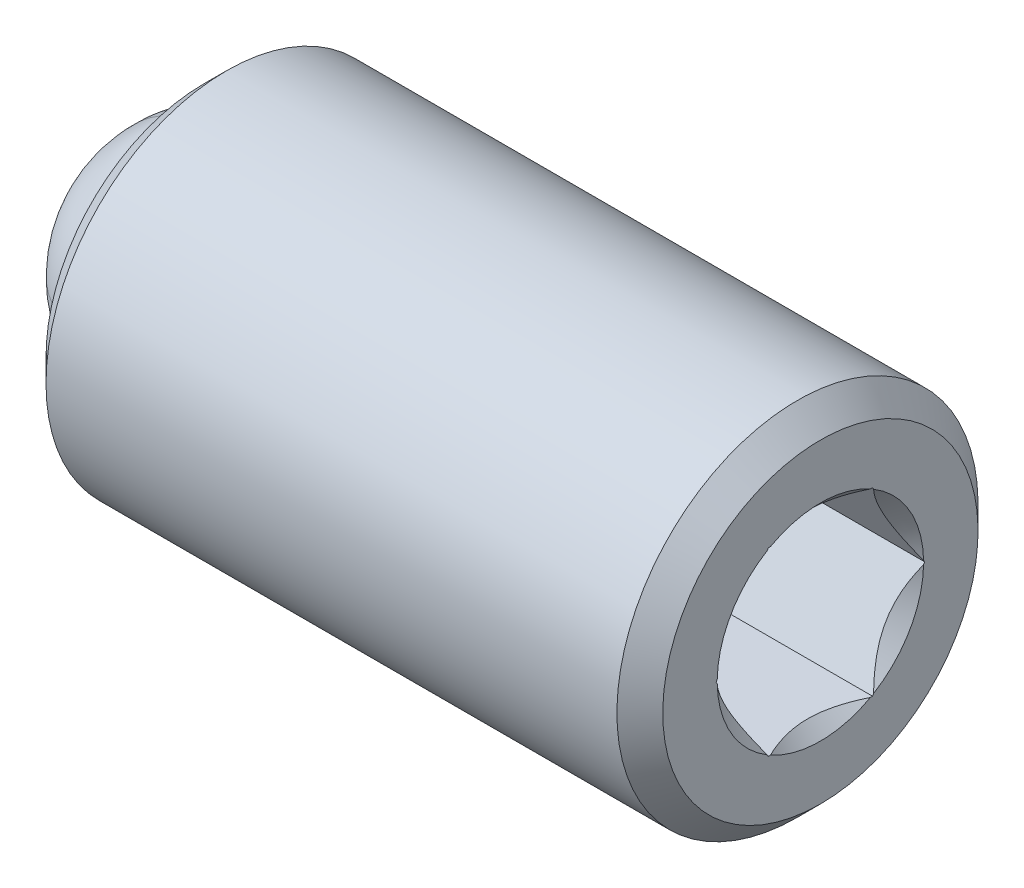
ISO-10303-21;
HEADER;
FILE_DESCRIPTION(('STEP AP214'),'2;1');
FILE_NAME('part.step','',(''),(''),'','','');
FILE_SCHEMA(('AUTOMOTIVE_DESIGN { 1 0 10303 214 1 1 1 1 }'));
ENDSEC;
DATA;
#1=APPLICATION_CONTEXT('core data for automotive mechanical design processes');
#2=APPLICATION_PROTOCOL_DEFINITION('international standard','automotive_design',2000,#1);
#3=PRODUCT_CONTEXT('',#1,'mechanical');
#4=PRODUCT('Part','Part','',(#3));
#5=PRODUCT_RELATED_PRODUCT_CATEGORY('part','',(#4));
#6=PRODUCT_DEFINITION_FORMATION('','',#4);
#7=PRODUCT_DEFINITION_CONTEXT('part definition',#1,'design');
#8=PRODUCT_DEFINITION('design','',#6,#7);
#9=PRODUCT_DEFINITION_SHAPE('','',#8);
#10=(LENGTH_UNIT() NAMED_UNIT(*) SI_UNIT(.MILLI.,.METRE.));
#11=(NAMED_UNIT(*) PLANE_ANGLE_UNIT() SI_UNIT($,.RADIAN.));
#12=(NAMED_UNIT(*) SI_UNIT($,.STERADIAN.) SOLID_ANGLE_UNIT());
#13=UNCERTAINTY_MEASURE_WITH_UNIT(LENGTH_MEASURE(1.E-05),#10,'distance_accuracy_value','');
#14=(GEOMETRIC_REPRESENTATION_CONTEXT(3) GLOBAL_UNCERTAINTY_ASSIGNED_CONTEXT((#13)) GLOBAL_UNIT_ASSIGNED_CONTEXT((#10,
#11,#12)) REPRESENTATION_CONTEXT('',''));
#15=CARTESIAN_POINT('',(0.,0.,0.));
#16=DIRECTION('',(0.,0.,1.));
#17=DIRECTION('',(1.,0.,0.));
#18=AXIS2_PLACEMENT_3D('',#15,#16,#17);
#19=CARTESIAN_POINT('',(-4.89996921003863,3.16697150748038,6.5711296971228));
#20=DIRECTION('',(1.,0.,0.));
#21=DIRECTION('',(0.,1.,0.));
#22=AXIS2_PLACEMENT_3D('',#19,#20,#21);
#23=PLANE('',#22);
#24=CARTESIAN_POINT('',(-4.89996921003863,1.76997150748039,6.5711296971228));
#25=DIRECTION('',(1.,0.,0.));
#26=DIRECTION('',(0.,1.,0.));
#27=AXIS2_PLACEMENT_3D('',#24,#25,#26);
#28=CIRCLE('',#27,1.74599999999999);
#29=CARTESIAN_POINT('',(-4.89996921003863,3.51597150748038,6.5711296971228));
#30=VERTEX_POINT('',#29);
#31=EDGE_CURVE('P0_E31',#30,#30,#28,.F.);
#32=ORIENTED_EDGE('',*,*,#31,.T.);
#33=EDGE_LOOP('',(#32));
#34=FACE_BOUND('',#33,.T.);
#35=CARTESIAN_POINT('',(-4.89996921003863,1.76997150748039,6.5711296971228));
#36=DIRECTION('',(-1.,0.,0.));
#37=DIRECTION('',(0.,-1.,0.));
#38=AXIS2_PLACEMENT_3D('',#35,#36,#37);
#39=CIRCLE('',#38,1.39699999999999);
#40=CARTESIAN_POINT('',(-4.89996921003864,0.372971507480394,6.5711296971228));
#41=VERTEX_POINT('',#40);
#42=EDGE_CURVE('P0_E248',#41,#41,#39,.T.);
#43=ORIENTED_EDGE('',*,*,#42,.F.);
#44=EDGE_LOOP('',(#43));
#45=FACE_BOUND('',#44,.T.);
#46=ADVANCED_FACE('P0_F17',(#34,#45),#23,.F.);
#47=CARTESIAN_POINT('',(-2.71487568355476,1.76997150748038,6.5711296971228));
#48=DIRECTION('',(-1.,0.,0.));
#49=DIRECTION('',(0.,-1.,0.));
#50=AXIS2_PLACEMENT_3D('',#47,#48,#49);
#51=CYLINDRICAL_SURFACE('',#50,1.39699999999999);
#52=CARTESIAN_POINT('',(-4.11187568355476,1.76997150748039,6.5711296971228));
#53=DIRECTION('',(-1.,0.,0.));
#54=DIRECTION('',(0.,-1.,0.));
#55=AXIS2_PLACEMENT_3D('',#52,#53,#54);
#56=CIRCLE('',#55,1.39699999999999);
#57=CARTESIAN_POINT('',(-4.11187568355476,0.372971507480392,6.5711296971228));
#58=VERTEX_POINT('',#57);
#59=EDGE_CURVE('P0_E231',#58,#58,#56,.T.);
#60=ORIENTED_EDGE('',*,*,#59,.F.);
#61=EDGE_LOOP('',(#60));
#62=FACE_BOUND('',#61,.T.);
#63=ORIENTED_EDGE('',*,*,#42,.T.);
#64=EDGE_LOOP('',(#63));
#65=FACE_BOUND('',#64,.T.);
#66=ADVANCED_FACE('P0_F274',(#62,#65),#51,.F.);
#67=CARTESIAN_POINT('',(-4.11187568355476,1.76997150748039,6.5711296971228));
#68=DIRECTION('',(-1.,0.,0.));
#69=DIRECTION('',(0.,-1.,0.));
#70=AXIS2_PLACEMENT_3D('',#67,#68,#69);
#71=CONICAL_SURFACE('',#70,1.39699999999999,0.785398163397447);
#72=CARTESIAN_POINT('',(-2.71487568355476,1.76997150748038,6.5711296971228));
#73=VERTEX_POINT('',#72);
#74=VERTEX_LOOP('',#73);
#75=FACE_BOUND('',#74,.T.);
#76=ORIENTED_EDGE('',*,*,#59,.T.);
#77=EDGE_LOOP('',(#76));
#78=FACE_BOUND('',#77,.T.);
#79=ADVANCED_FACE('P0_F279',(#75,#78),#71,.F.);
#80=CARTESIAN_POINT('',(1.93163078996137,1.76997150748038,6.5711296971228));
#81=DIRECTION('',(-1.,0.,0.));
#82=DIRECTION('',(0.,-1.,0.));
#83=AXIS2_PLACEMENT_3D('',#80,#81,#82);
#84=PLANE('',#83);
#85=DIRECTION('',(0.,-0.866025403784439,-0.5));
#86=VECTOR('',#85,1.);
#87=CARTESIAN_POINT('',(1.93163078996137,1.76997150748038,7.72583023550205));
#88=LINE('',#87,#86);
#89=CARTESIAN_POINT('',(1.93163078996137,0.790558585251532,7.16036592120543));
#90=VERTEX_POINT('',#89);
#91=CARTESIAN_POINT('',(1.93163078996137,0.769971507480377,7.14847996631243));
#92=VERTEX_POINT('',#91);
#93=EDGE_CURVE('P0_E209',#90,#92,#88,.T.);
#94=ORIENTED_EDGE('',*,*,#93,.F.);
#95=CARTESIAN_POINT('',(1.93163078996137,1.76997150748038,6.5711296971228));
#96=DIRECTION('',(1.,0.,0.));
#97=DIRECTION('',(0.,1.,0.));
#98=AXIS2_PLACEMENT_3D('',#95,#96,#97);
#99=CIRCLE('',#98,1.143);
#100=CARTESIAN_POINT('',(1.93163078996137,1.74938442970922,7.71394428060905));
#101=VERTEX_POINT('',#100);
#102=EDGE_CURVE('P0_E301',#101,#90,#99,.T.);
#103=ORIENTED_EDGE('',*,*,#102,.F.);
#104=CARTESIAN_POINT('',(1.93163078996137,1.76997150748038,7.72583023550205));
#105=VERTEX_POINT('',#104);
#106=EDGE_CURVE('P0_E210',#105,#101,#88,.T.);
#107=ORIENTED_EDGE('',*,*,#106,.F.);
#108=DIRECTION('',(0.,-0.866025403784438,0.5));
#109=VECTOR('',#108,1.);
#110=CARTESIAN_POINT('',(1.93163078996137,2.76997150748038,7.14847996631243));
#111=LINE('',#110,#109);
#112=CARTESIAN_POINT('',(1.93163078996137,1.79055858525153,7.71394428060905));
#113=VERTEX_POINT('',#112);
#114=EDGE_CURVE('P0_E179',#113,#105,#111,.T.);
#115=ORIENTED_EDGE('',*,*,#114,.F.);
#116=CARTESIAN_POINT('',(1.93163078996137,2.74938442970922,7.16036592120543));
#117=VERTEX_POINT('',#116);
#118=EDGE_CURVE('P0_E37',#117,#113,#99,.T.);
#119=ORIENTED_EDGE('',*,*,#118,.F.);
#120=CARTESIAN_POINT('',(1.93163078996137,2.76997150748038,7.14847996631243));
#121=VERTEX_POINT('',#120);
#122=EDGE_CURVE('P0_E206',#121,#117,#111,.T.);
#123=ORIENTED_EDGE('',*,*,#122,.F.);
#124=DIRECTION('',(0.,0.,1.));
#125=VECTOR('',#124,1.);
#126=CARTESIAN_POINT('',(1.93163078996137,2.76997150748038,5.99377942793318));
#127=LINE('',#126,#125);
#128=CARTESIAN_POINT('',(1.93163078996137,2.76997150748038,7.12470805652641));
#129=VERTEX_POINT('',#128);
#130=EDGE_CURVE('P0_E225',#129,#121,#127,.T.);
#131=ORIENTED_EDGE('',*,*,#130,.F.);
#132=CARTESIAN_POINT('',(1.93163078996137,2.76997150748038,6.01755133771919));
#133=VERTEX_POINT('',#132);
#134=EDGE_CURVE('P0_E44',#133,#129,#99,.T.);
#135=ORIENTED_EDGE('',*,*,#134,.F.);
#136=CARTESIAN_POINT('',(1.93163078996137,2.76997150748038,5.99377942793318));
#137=VERTEX_POINT('',#136);
#138=EDGE_CURVE('P0_E190',#137,#133,#127,.T.);
#139=ORIENTED_EDGE('',*,*,#138,.F.);
#140=DIRECTION('',(0.,0.866025403784439,0.5));
#141=VECTOR('',#140,1.);
#142=CARTESIAN_POINT('',(1.93163078996137,1.76997150748038,5.41642915874355));
#143=LINE('',#142,#141);
#144=CARTESIAN_POINT('',(1.93163078996137,2.74938442970922,5.98189347304017));
#145=VERTEX_POINT('',#144);
#146=EDGE_CURVE('P0_E221',#145,#137,#143,.T.);
#147=ORIENTED_EDGE('',*,*,#146,.F.);
#148=CARTESIAN_POINT('',(1.93163078996137,1.79055858525153,5.42831511363655));
#149=VERTEX_POINT('',#148);
#150=EDGE_CURVE('P0_E128',#149,#145,#99,.T.);
#151=ORIENTED_EDGE('',*,*,#150,.F.);
#152=CARTESIAN_POINT('',(1.93163078996137,1.76997150748038,5.41642915874355));
#153=VERTEX_POINT('',#152);
#154=EDGE_CURVE('P0_E222',#153,#149,#143,.T.);
#155=ORIENTED_EDGE('',*,*,#154,.F.);
#156=DIRECTION('',(0.,0.866025403784439,-0.5));
#157=VECTOR('',#156,1.);
#158=CARTESIAN_POINT('',(1.93163078996137,0.769971507480377,5.99377942793318));
#159=LINE('',#158,#157);
#160=CARTESIAN_POINT('',(1.93163078996137,1.74938442970922,5.42831511363655));
#161=VERTEX_POINT('',#160);
#162=EDGE_CURVE('P0_E217',#161,#153,#159,.T.);
#163=ORIENTED_EDGE('',*,*,#162,.F.);
#164=CARTESIAN_POINT('',(1.93163078996137,0.790558585251531,5.98189347304017));
#165=VERTEX_POINT('',#164);
#166=EDGE_CURVE('P0_E328',#165,#161,#99,.T.);
#167=ORIENTED_EDGE('',*,*,#166,.F.);
#168=CARTESIAN_POINT('',(1.93163078996137,0.769971507480377,5.99377942793318));
#169=VERTEX_POINT('',#168);
#170=EDGE_CURVE('P0_E218',#169,#165,#159,.T.);
#171=ORIENTED_EDGE('',*,*,#170,.F.);
#172=DIRECTION('',(0.,0.,-1.));
#173=VECTOR('',#172,1.);
#174=CARTESIAN_POINT('',(1.93163078996137,0.769971507480377,7.14847996631243));
#175=LINE('',#174,#173);
#176=CARTESIAN_POINT('',(1.93163078996137,0.769971507480377,6.01755133771918));
#177=VERTEX_POINT('',#176);
#178=EDGE_CURVE('P0_E213',#177,#169,#175,.T.);
#179=ORIENTED_EDGE('',*,*,#178,.F.);
#180=CARTESIAN_POINT('',(1.93163078996137,0.769971507480377,7.12470805652642));
#181=VERTEX_POINT('',#180);
#182=EDGE_CURVE('P0_E327',#181,#177,#99,.T.);
#183=ORIENTED_EDGE('',*,*,#182,.F.);
#184=EDGE_CURVE('P0_E214',#92,#181,#175,.T.);
#185=ORIENTED_EDGE('',*,*,#184,.F.);
#186=EDGE_LOOP('',(#94,#103,#107,#115,#119,#123,#131,#135,#139,#147,#151,#155,#163,#167,#171,
#179,#183,#185));
#187=FACE_BOUND('',#186,.T.);
#188=CARTESIAN_POINT('',(1.93163078996137,1.76997150748038,6.5711296971228));
#189=DIRECTION('',(-1.,0.,0.));
#190=DIRECTION('',(0.,-1.,0.));
#191=AXIS2_PLACEMENT_3D('',#188,#189,#190);
#192=CIRCLE('',#191,1.746);
#193=CARTESIAN_POINT('',(1.93163078996137,0.0239715074803807,6.5711296971228));
#194=VERTEX_POINT('',#193);
#195=EDGE_CURVE('P0_E257',#194,#194,#192,.F.);
#196=ORIENTED_EDGE('',*,*,#195,.T.);
#197=EDGE_LOOP('',(#196));
#198=FACE_BOUND('',#197,.T.);
#199=ADVANCED_FACE('P0_F284',(#187,#198),#84,.F.);
#200=CARTESIAN_POINT('',(-2.71487568355476,1.76997150748038,6.5711296971228));
#201=DIRECTION('',(-1.,0.,0.));
#202=DIRECTION('',(0.,-1.,0.));
#203=AXIS2_PLACEMENT_3D('',#200,#201,#202);
#204=CYLINDRICAL_SURFACE('',#203,2.);
#205=CARTESIAN_POINT('',(1.67763078996137,1.76997150748038,6.5711296971228));
#206=DIRECTION('',(-1.,0.,0.));
#207=DIRECTION('',(0.,-1.,0.));
#208=AXIS2_PLACEMENT_3D('',#205,#206,#207);
#209=CIRCLE('',#208,2.);
#210=CARTESIAN_POINT('',(1.67763078996137,-0.230028492519616,6.5711296971228));
#211=VERTEX_POINT('',#210);
#212=EDGE_CURVE('P0_E254',#211,#211,#209,.T.);
#213=ORIENTED_EDGE('',*,*,#212,.T.);
#214=EDGE_LOOP('',(#213));
#215=FACE_BOUND('',#214,.T.);
#216=CARTESIAN_POINT('',(-4.64596921003863,1.76997150748039,6.5711296971228));
#217=DIRECTION('',(1.,0.,0.));
#218=DIRECTION('',(0.,1.,0.));
#219=AXIS2_PLACEMENT_3D('',#216,#217,#218);
#220=CIRCLE('',#219,2.);
#221=CARTESIAN_POINT('',(-4.64596921003863,3.76997150748038,6.5711296971228));
#222=VERTEX_POINT('',#221);
#223=EDGE_CURVE('P0_E251',#222,#222,#220,.T.);
#224=ORIENTED_EDGE('',*,*,#223,.T.);
#225=EDGE_LOOP('',(#224));
#226=FACE_BOUND('',#225,.T.);
#227=ADVANCED_FACE('P0_F169',(#215,#226),#204,.T.);
#228=CARTESIAN_POINT('',(1.67763078996137,1.76997150748038,6.5711296971228));
#229=DIRECTION('',(-1.,0.,0.));
#230=DIRECTION('',(0.,-1.,0.));
#231=AXIS2_PLACEMENT_3D('',#228,#229,#230);
#232=CONICAL_SURFACE('',#231,2.,0.78539816339745);
#233=ORIENTED_EDGE('',*,*,#195,.F.);
#234=EDGE_LOOP('',(#233));
#235=FACE_BOUND('',#234,.T.);
#236=ORIENTED_EDGE('',*,*,#212,.F.);
#237=EDGE_LOOP('',(#236));
#238=FACE_BOUND('',#237,.T.);
#239=ADVANCED_FACE('P0_F265',(#235,#238),#232,.T.);
#240=CARTESIAN_POINT('',(-4.89996921003863,1.76997150748039,6.5711296971228));
#241=DIRECTION('',(1.,0.,0.));
#242=DIRECTION('',(0.,1.,0.));
#243=AXIS2_PLACEMENT_3D('',#240,#241,#242);
#244=CONICAL_SURFACE('',#243,1.74599999999999,0.785398163397448);
#245=ORIENTED_EDGE('',*,*,#223,.F.);
#246=EDGE_LOOP('',(#245));
#247=FACE_BOUND('',#246,.T.);
#248=ORIENTED_EDGE('',*,*,#31,.F.);
#249=EDGE_LOOP('',(#248));
#250=FACE_BOUND('',#249,.T.);
#251=ADVANCED_FACE('P0_F19',(#247,#250),#244,.T.);
#252=CARTESIAN_POINT('',(-1.11636921003863,2.76997150748038,7.14847996631243));
#253=DIRECTION('',(0.,0.5,0.866025403784439));
#254=DIRECTION('',(0.,-0.866025403784439,0.5));
#255=AXIS2_PLACEMENT_3D('',#252,#253,#254);
#256=PLANE('',#255);
#257=ORIENTED_EDGE('',*,*,#122,.T.);
#258=CARTESIAN_POINT('',(1.93183078996141,2.74974195258936,7.16015950527434));
#259=CARTESIAN_POINT('',(1.91326964555421,2.71654713089326,7.17932454451629));
#260=CARTESIAN_POINT('',(1.89585236417637,2.68280947576868,7.19880298878429));
#261=CARTESIAN_POINT('',(1.86405946806699,2.61408246663234,7.23848254600976));
#262=CARTESIAN_POINT('',(1.8497000505181,2.57908754136444,7.25868687553345));
#263=CARTESIAN_POINT('',(1.82516483078225,2.50853700076551,7.29941924913971));
#264=CARTESIAN_POINT('',(1.81493156980658,2.47299679603105,7.31993839591021));
#265=CARTESIAN_POINT('',(1.79922973927466,2.40119224228067,7.36139477434703));
#266=CARTESIAN_POINT('',(1.79375059553354,2.36492968480921,7.38233097166468));
#267=CARTESIAN_POINT('',(1.78880357526688,2.30144311490255,7.41898495989022));
#268=CARTESIAN_POINT('',(1.78815442223121,2.27428612748318,7.43466405388717));
#269=CARTESIAN_POINT('',(1.78980077512239,2.22003656081593,7.46598505580593));
#270=CARTESIAN_POINT('',(1.79209701869288,2.19294399940549,7.48162695342928));
#271=CARTESIAN_POINT('',(1.80324596140021,2.11207692848176,7.52831557859567));
#272=CARTESIAN_POINT('',(1.81635927804524,2.05871871354888,7.55912195835065));
#273=CARTESIAN_POINT('',(1.84639000187763,1.96924049829465,7.61078223001428));
#274=CARTESIAN_POINT('',(1.86116486968595,1.93253374949866,7.63197488131273));
#275=CARTESIAN_POINT('',(1.89416210365698,1.86043083474798,7.67360351855339));
#276=CARTESIAN_POINT('',(1.9123727988562,1.82503070348737,7.69404179386605));
#277=CARTESIAN_POINT('',(1.93183078996137,1.79020106237147,7.71415069654009));
#278=B_SPLINE_CURVE_WITH_KNOTS('',3,(#258,#259,#260,#261,#262,#263,#264,#265,#266,#267,#268,
#269,#270,#271,#272,#273,#274,#275,#276,#277),.UNSPECIFIED.,.F.,.F.,(4,2,2,2,2,2,2,2,2,4),(0.,
0.127843602213512,0.256348402717749,0.382996178290257,0.509361534369396,0.603319243404815,
0.697300487756688,0.885282386019179,1.0198021169556,1.15387287456321),.UNSPECIFIED.);
#279=EDGE_CURVE('P0_E172',#117,#113,#278,.T.);
#280=ORIENTED_EDGE('',*,*,#279,.T.);
#281=ORIENTED_EDGE('',*,*,#114,.T.);
#282=DIRECTION('',(1.,0.,0.));
#283=VECTOR('',#282,1.);
#284=CARTESIAN_POINT('',(-1.11636921003863,1.76997150748038,7.72583023550205));
#285=LINE('',#284,#283);
#286=CARTESIAN_POINT('',(-1.11636921003863,1.76997150748038,7.72583023550205));
#287=VERTEX_POINT('',#286);
#288=EDGE_CURVE('P0_E205',#287,#105,#285,.T.);
#289=ORIENTED_EDGE('',*,*,#288,.F.);
#290=DIRECTION('',(0.,-0.866025403784438,0.5));
#291=VECTOR('',#290,1.);
#292=CARTESIAN_POINT('',(-1.11636921003863,2.76997150748038,7.14847996631243));
#293=LINE('',#292,#291);
#294=CARTESIAN_POINT('',(-1.11636921003863,2.76997150748038,7.14847996631243));
#295=VERTEX_POINT('',#294);
#296=EDGE_CURVE('P0_E186',#295,#287,#293,.T.);
#297=ORIENTED_EDGE('',*,*,#296,.F.);
#298=DIRECTION('',(1.,0.,0.));
#299=VECTOR('',#298,1.);
#300=CARTESIAN_POINT('',(-1.11636921003863,2.76997150748038,7.14847996631243));
#301=LINE('',#300,#299);
#302=EDGE_CURVE('P0_E228',#295,#121,#301,.T.);
#303=ORIENTED_EDGE('',*,*,#302,.T.);
#304=EDGE_LOOP('',(#257,#280,#281,#289,#297,#303));
#305=FACE_BOUND('',#304,.T.);
#306=ADVANCED_FACE('P0_F163',(#305),#256,.F.);
#307=CARTESIAN_POINT('',(-1.11636921003863,2.76997150748038,5.99377942793318));
#308=DIRECTION('',(0.,1.,0.));
#309=DIRECTION('',(0.,0.,1.));
#310=AXIS2_PLACEMENT_3D('',#307,#308,#309);
#311=PLANE('',#310);
#312=ORIENTED_EDGE('',*,*,#138,.T.);
#313=CARTESIAN_POINT('',(2.30765062153252,2.76997150748038,5.42770447057475));
#314=CARTESIAN_POINT('',(2.28666877925322,2.76997150748038,5.4555827288182));
#315=CARTESIAN_POINT('',(2.26589506259974,2.76997150748038,5.48361719422909));
#316=CARTESIAN_POINT('',(2.22484960514454,2.76997150748038,5.54006161279602));
#317=CARTESIAN_POINT('',(2.20457799194436,2.76997150748038,5.56847165864265));
#318=CARTESIAN_POINT('',(2.14435576831915,2.76997150748038,5.65477564253619));
#319=CARTESIAN_POINT('',(2.10532102066028,2.76997150748038,5.7133194795158));
#320=CARTESIAN_POINT('',(2.02876428043044,2.76997150748038,5.83603202195574));
#321=CARTESIAN_POINT('',(1.99145026924702,2.76997150748038,5.900331990195));
#322=CARTESIAN_POINT('',(1.92324622310679,2.76997150748038,6.03213319229048));
#323=CARTESIAN_POINT('',(1.89233454372988,2.76997150748038,6.09962266027701));
#324=CARTESIAN_POINT('',(1.85451944798575,2.76997150748038,6.2010025136125));
#325=CARTESIAN_POINT('',(1.84365291748937,2.76997150748038,6.23340895525658));
#326=CARTESIAN_POINT('',(1.8245225836576,2.76997150748038,6.29899715601625));
#327=CARTESIAN_POINT('',(1.81625896190331,2.76997150748038,6.33217896904903));
#328=CARTESIAN_POINT('',(1.80290016703791,2.76997150748038,6.39856371940977));
#329=CARTESIAN_POINT('',(1.79775073564466,2.76997150748038,6.4317555663625));
#330=CARTESIAN_POINT('',(1.79071626018891,2.76997150748038,6.49849622249986));
#331=CARTESIAN_POINT('',(1.78883173187345,2.76997150748038,6.53204508723952));
#332=CARTESIAN_POINT('',(1.78846691979187,2.76997150748038,6.59798111659323));
#333=CARTESIAN_POINT('',(1.7898693344448,2.76997150748038,6.6303676752817));
#334=CARTESIAN_POINT('',(1.79574312450813,2.76997150748038,6.69484868968948));
#335=CARTESIAN_POINT('',(1.80021380048467,2.76997150748038,6.72694321029196));
#336=CARTESIAN_POINT('',(1.81205724930662,2.76997150748038,6.79116706630148));
#337=CARTESIAN_POINT('',(1.81947958733091,2.76997150748038,6.82328712339601));
#338=CARTESIAN_POINT('',(1.83683426089415,2.76997150748038,6.88682642025622));
#339=CARTESIAN_POINT('',(1.84676637656934,2.76997150748038,6.91824572114791));
#340=CARTESIAN_POINT('',(1.88188036188272,2.76997150748038,7.01753752929315));
#341=CARTESIAN_POINT('',(1.9110766339602,2.76997150748038,7.08398700537221));
#342=CARTESIAN_POINT('',(1.97598006961068,2.76997150748038,7.21376086221266));
#343=CARTESIAN_POINT('',(2.01171070060643,2.76997150748038,7.27707289855517));
#344=CARTESIAN_POINT('',(2.08541426633599,2.76997150748038,7.3980656626257));
#345=CARTESIAN_POINT('',(2.12318706195873,2.76997150748038,7.4558698295022));
#346=CARTESIAN_POINT('',(2.18157484880979,2.76997150748038,7.5410328209196));
#347=CARTESIAN_POINT('',(2.20124234221794,2.76997150748038,7.56905273281464));
#348=CARTESIAN_POINT('',(2.24109616038701,2.76997150748038,7.62470995767974));
#349=CARTESIAN_POINT('',(2.26128234187786,2.76997150748038,7.65234737312427));
#350=CARTESIAN_POINT('',(2.28168355047466,2.76997150748038,7.67982557322064));
#351=B_SPLINE_CURVE_WITH_KNOTS('',3,(#313,#314,#315,#316,#317,#318,#319,#320,#321,#322,#323,
#324,#325,#326,#327,#328,#329,#330,#331,#332,#333,#334,#335,#336,#337,#338,#339,#340,#341,#342,
#343,#344,#345,#346,#347,#348,#349,#350),.UNSPECIFIED.,.F.,.F.,(4,2,2,2,2,2,2,2,2,2,2,2,2,2,2,2,
2,2,4),(0.,0.104672600389282,0.209371534234618,0.42036778045893,0.643210412340021,
0.865286917192373,0.96773942921369,1.07019908682584,1.17081790990773,1.27145262599738,
1.36855093112557,1.46562710929396,1.56440734068322,1.66317892163757,1.88028105971957,
2.09817877978304,2.30523049071308,2.40792678539327,2.51059501231902),.UNSPECIFIED.);
#352=EDGE_CURVE('P0_E180',#133,#129,#351,.T.);
#353=ORIENTED_EDGE('',*,*,#352,.T.);
#354=ORIENTED_EDGE('',*,*,#130,.T.);
#355=ORIENTED_EDGE('',*,*,#302,.F.);
#356=DIRECTION('',(0.,0.,1.));
#357=VECTOR('',#356,1.);
#358=CARTESIAN_POINT('',(-1.11636921003863,2.76997150748038,5.99377942793318));
#359=LINE('',#358,#357);
#360=CARTESIAN_POINT('',(-1.11636921003863,2.76997150748038,5.99377942793318));
#361=VERTEX_POINT('',#360);
#362=EDGE_CURVE('P0_E202',#361,#295,#359,.T.);
#363=ORIENTED_EDGE('',*,*,#362,.F.);
#364=DIRECTION('',(1.,0.,0.));
#365=VECTOR('',#364,1.);
#366=CARTESIAN_POINT('',(-1.11636921003863,2.76997150748038,5.99377942793318));
#367=LINE('',#366,#365);
#368=EDGE_CURVE('P0_E232',#361,#137,#367,.T.);
#369=ORIENTED_EDGE('',*,*,#368,.T.);
#370=EDGE_LOOP('',(#312,#353,#354,#355,#363,#369));
#371=FACE_BOUND('',#370,.T.);
#372=ADVANCED_FACE('P0_F167',(#371),#311,.F.);
#373=CARTESIAN_POINT('',(-1.11636921003863,1.76997150748038,5.41642915874355));
#374=DIRECTION('',(0.,0.5,-0.866025403784439));
#375=DIRECTION('',(0.,0.866025403784439,0.5));
#376=AXIS2_PLACEMENT_3D('',#373,#374,#375);
#377=PLANE('',#376);
#378=ORIENTED_EDGE('',*,*,#154,.T.);
#379=CARTESIAN_POINT('',(1.93183078996137,1.79020106237147,5.42810869770551));
#380=CARTESIAN_POINT('',(1.91326964555417,1.82339588406757,5.44727373694745));
#381=CARTESIAN_POINT('',(1.89585236417634,1.85713353919214,5.46675218121545));
#382=CARTESIAN_POINT('',(1.86405946806696,1.92586054832848,5.50643173844091));
#383=CARTESIAN_POINT('',(1.84970005051807,1.96085547359637,5.5266360679646));
#384=CARTESIAN_POINT('',(1.82516483078223,2.03140601419529,5.56736844157086));
#385=CARTESIAN_POINT('',(1.81493156980657,2.06694621892975,5.58788758834135));
#386=CARTESIAN_POINT('',(1.79922973927465,2.13875077268011,5.62934396677817));
#387=CARTESIAN_POINT('',(1.79375059553353,2.17501333015157,5.65028016409582));
#388=CARTESIAN_POINT('',(1.78880357526688,2.23849990005822,5.68693415232135));
#389=CARTESIAN_POINT('',(1.78815442223121,2.26565688747759,5.7026132463183));
#390=CARTESIAN_POINT('',(1.78980077512239,2.31990645414484,5.73393424823706));
#391=CARTESIAN_POINT('',(1.79209701869288,2.34699901555528,5.74957614586041));
#392=CARTESIAN_POINT('',(1.80324596140021,2.42786608647901,5.7962647710268));
#393=CARTESIAN_POINT('',(1.81635927804525,2.48122430141189,5.82707115078178));
#394=CARTESIAN_POINT('',(1.84639000187764,2.57070251666613,5.87873142244542));
#395=CARTESIAN_POINT('',(1.86116486968597,2.60740926546213,5.89992407374387));
#396=CARTESIAN_POINT('',(1.89416210365701,2.67951218021283,5.94155271098454));
#397=CARTESIAN_POINT('',(1.91237279885624,2.71491231147346,5.96199098629722));
#398=CARTESIAN_POINT('',(1.93183078996141,2.74974195258936,5.98209988897126));
#399=B_SPLINE_CURVE_WITH_KNOTS('',3,(#379,#380,#381,#382,#383,#384,#385,#386,#387,#388,#389,
#390,#391,#392,#393,#394,#395,#396,#397,#398),.UNSPECIFIED.,.F.,.F.,(4,2,2,2,2,2,2,2,2,4),(0.,
0.127843602213492,0.256348402717709,0.382996178290198,0.509361534369316,0.603319243404734,
0.697300487756606,0.885282386019097,1.01980211695556,1.15387287456321),.UNSPECIFIED.);
#400=EDGE_CURVE('P0_E335',#149,#145,#399,.T.);
#401=ORIENTED_EDGE('',*,*,#400,.T.);
#402=ORIENTED_EDGE('',*,*,#146,.T.);
#403=ORIENTED_EDGE('',*,*,#368,.F.);
#404=DIRECTION('',(0.,0.866025403784439,0.5));
#405=VECTOR('',#404,1.);
#406=CARTESIAN_POINT('',(-1.11636921003863,1.76997150748038,5.41642915874355));
#407=LINE('',#406,#405);
#408=CARTESIAN_POINT('',(-1.11636921003863,1.76997150748038,5.41642915874355));
#409=VERTEX_POINT('',#408);
#410=EDGE_CURVE('P0_E199',#409,#361,#407,.T.);
#411=ORIENTED_EDGE('',*,*,#410,.F.);
#412=DIRECTION('',(1.,0.,0.));
#413=VECTOR('',#412,1.);
#414=CARTESIAN_POINT('',(-1.11636921003863,1.76997150748038,5.41642915874355));
#415=LINE('',#414,#413);
#416=EDGE_CURVE('P0_E235',#409,#153,#415,.T.);
#417=ORIENTED_EDGE('',*,*,#416,.T.);
#418=EDGE_LOOP('',(#378,#401,#402,#403,#411,#417));
#419=FACE_BOUND('',#418,.T.);
#420=ADVANCED_FACE('P0_F339',(#419),#377,.F.);
#421=CARTESIAN_POINT('',(-1.11636921003863,0.769971507480377,5.99377942793318));
#422=DIRECTION('',(0.,-0.5,-0.866025403784439));
#423=DIRECTION('',(0.,0.866025403784439,-0.5));
#424=AXIS2_PLACEMENT_3D('',#421,#422,#423);
#425=PLANE('',#424);
#426=ORIENTED_EDGE('',*,*,#170,.T.);
#427=CARTESIAN_POINT('',(1.93183078996141,0.790201062371386,5.98209988897127));
#428=CARTESIAN_POINT('',(1.91326964555421,0.823395884067494,5.96293484972932));
#429=CARTESIAN_POINT('',(1.89585236417637,0.857133539192068,5.94345640546132));
#430=CARTESIAN_POINT('',(1.86405946806699,0.925860548328415,5.90377684823585));
#431=CARTESIAN_POINT('',(1.84970005051809,0.960855473596315,5.88357251871216));
#432=CARTESIAN_POINT('',(1.82516483078225,1.03140601419525,5.84284014510589));
#433=CARTESIAN_POINT('',(1.81493156980658,1.0669462189297,5.8223209983354));
#434=CARTESIAN_POINT('',(1.79922973927465,1.13875077268008,5.78086461989857));
#435=CARTESIAN_POINT('',(1.79375059553354,1.17501333015154,5.75992842258092));
#436=CARTESIAN_POINT('',(1.78880357526688,1.23849990005821,5.72327443435538));
#437=CARTESIAN_POINT('',(1.78815442223121,1.26565688747757,5.70759534035843));
#438=CARTESIAN_POINT('',(1.78980077512239,1.31990645414482,5.67627433843967));
#439=CARTESIAN_POINT('',(1.79209701869288,1.34699901555526,5.66063244081632));
#440=CARTESIAN_POINT('',(1.80324596140021,1.42786608647899,5.61394381564993));
#441=CARTESIAN_POINT('',(1.81635927804524,1.48122430141188,5.58313743589495));
#442=CARTESIAN_POINT('',(1.84639000187763,1.5707025166661,5.53147716423132));
#443=CARTESIAN_POINT('',(1.86116486968595,1.60740926546209,5.51028451293288));
#444=CARTESIAN_POINT('',(1.89416210365698,1.67951218021277,5.46865587569221));
#445=CARTESIAN_POINT('',(1.9123727988562,1.71491231147339,5.44821760037955));
#446=CARTESIAN_POINT('',(1.93183078996137,1.74974195258929,5.42810869770551));
#447=B_SPLINE_CURVE_WITH_KNOTS('',3,(#427,#428,#429,#430,#431,#432,#433,#434,#435,#436,#437,
#438,#439,#440,#441,#442,#443,#444,#445,#446),.UNSPECIFIED.,.F.,.F.,(4,2,2,2,2,2,2,2,2,4),(0.,
0.127843602213513,0.25634840271775,0.38299617829026,0.5093615343694,0.603319243404818,
0.697300487756691,0.885282386019181,1.01980211695561,1.15387287456322),.UNSPECIFIED.);
#448=EDGE_CURVE('P0_E141',#165,#161,#447,.T.);
#449=ORIENTED_EDGE('',*,*,#448,.T.);
#450=ORIENTED_EDGE('',*,*,#162,.T.);
#451=ORIENTED_EDGE('',*,*,#416,.F.);
#452=DIRECTION('',(0.,0.866025403784439,-0.5));
#453=VECTOR('',#452,1.);
#454=CARTESIAN_POINT('',(-1.11636921003863,0.769971507480377,5.99377942793318));
#455=LINE('',#454,#453);
#456=CARTESIAN_POINT('',(-1.11636921003863,0.769971507480377,5.99377942793318));
#457=VERTEX_POINT('',#456);
#458=EDGE_CURVE('P0_E196',#457,#409,#455,.T.);
#459=ORIENTED_EDGE('',*,*,#458,.F.);
#460=DIRECTION('',(1.,0.,0.));
#461=VECTOR('',#460,1.);
#462=CARTESIAN_POINT('',(-1.11636921003863,0.769971507480377,5.99377942793318));
#463=LINE('',#462,#461);
#464=EDGE_CURVE('P0_E238',#457,#169,#463,.T.);
#465=ORIENTED_EDGE('',*,*,#464,.T.);
#466=EDGE_LOOP('',(#426,#449,#450,#451,#459,#465));
#467=FACE_BOUND('',#466,.T.);
#468=ADVANCED_FACE('P0_F154',(#467),#425,.F.);
#469=CARTESIAN_POINT('',(-1.11636921003863,0.769971507480377,7.14847996631243));
#470=DIRECTION('',(0.,-1.,0.));
#471=DIRECTION('',(0.,0.,-1.));
#472=AXIS2_PLACEMENT_3D('',#469,#470,#471);
#473=PLANE('',#472);
#474=ORIENTED_EDGE('',*,*,#184,.T.);
#475=CARTESIAN_POINT('',(2.30765062173199,0.769971507480376,5.42770447030976));
#476=CARTESIAN_POINT('',(2.28666877944501,0.769971507480376,5.45558272856061));
#477=CARTESIAN_POINT('',(2.26589506278387,0.769971507480376,5.48361719397892));
#478=CARTESIAN_POINT('',(2.22484960531339,0.769971507480376,5.54006161256078));
#479=CARTESIAN_POINT('',(2.20457799210558,0.769971507480377,5.5684716584149));
#480=CARTESIAN_POINT('',(2.14435576845737,0.769971507480377,5.65477564233139));
#481=CARTESIAN_POINT('',(2.10532102078323,0.769971507480377,5.71331947932661));
#482=CARTESIAN_POINT('',(2.028764280522,0.769971507480377,5.83603202180059));
#483=CARTESIAN_POINT('',(1.99145026932257,0.769971507480377,5.90033199005838));
#484=CARTESIAN_POINT('',(1.92324622315267,0.769971507480377,6.03213319219247));
#485=CARTESIAN_POINT('',(1.89233454376208,0.769971507480377,6.09962266019909));
#486=CARTESIAN_POINT('',(1.85451944800773,0.769971507480377,6.20100251354972));
#487=CARTESIAN_POINT('',(1.84365291751168,0.769971507480377,6.23340895518749));
#488=CARTESIAN_POINT('',(1.82452258367931,0.769971507480377,6.29899715593436));
#489=CARTESIAN_POINT('',(1.81625896192408,0.769971507480377,6.33217896896064));
#490=CARTESIAN_POINT('',(1.80290016705533,0.769971507480377,6.3985637193086));
#491=CARTESIAN_POINT('',(1.79775073565971,0.769971507480377,6.43175556625505));
#492=CARTESIAN_POINT('',(1.7907162601978,0.769971507480377,6.49849622238007));
#493=CARTESIAN_POINT('',(1.78883173187856,0.769971507480377,6.53204508711366));
#494=CARTESIAN_POINT('',(1.78846691978836,0.769971507480377,6.59798111645604));
#495=CARTESIAN_POINT('',(1.78986933443651,0.769971507480377,6.63036767513923));
#496=CARTESIAN_POINT('',(1.79574312448954,0.769971507480377,6.69484868953696));
#497=CARTESIAN_POINT('',(1.80021380046055,0.769971507480377,6.72694321013469));
#498=CARTESIAN_POINT('',(1.8120572492709,0.769971507480377,6.7911670661348));
#499=CARTESIAN_POINT('',(1.81947958728909,0.769971507480377,6.82328712322471));
#500=CARTESIAN_POINT('',(1.83683426083998,0.769971507480377,6.8868264200761));
#501=CARTESIAN_POINT('',(1.84676637650893,0.769971507480377,6.9182457209636));
#502=CARTESIAN_POINT('',(1.88188036179278,0.769971507480377,7.01753752906855));
#503=CARTESIAN_POINT('',(1.91107663384307,0.769971507480377,7.08398700511352));
#504=CARTESIAN_POINT('',(1.97598006943619,0.769971507480377,7.21376086188841));
#505=CARTESIAN_POINT('',(2.01171070040174,0.769971507480377,7.27707289819947));
#506=CARTESIAN_POINT('',(2.0854142660735,0.769971507480377,7.39806566221343));
#507=CARTESIAN_POINT('',(2.12318706166891,0.769971507480377,7.45586982906461));
#508=CARTESIAN_POINT('',(2.18157484847909,0.769971507480377,7.54103282044459));
#509=CARTESIAN_POINT('',(2.20124234187374,0.769971507480377,7.56905273232733));
#510=CARTESIAN_POINT('',(2.24109616001579,0.769971507480377,7.62470995716791));
#511=CARTESIAN_POINT('',(2.26128234149315,0.769971507480377,7.65234737260023));
#512=CARTESIAN_POINT('',(2.28168355007646,0.769971507480377,7.6798255726844));
#513=B_SPLINE_CURVE_WITH_KNOTS('',3,(#475,#476,#477,#478,#479,#480,#481,#482,#483,#484,#485,
#486,#487,#488,#489,#490,#491,#492,#493,#494,#495,#496,#497,#498,#499,#500,#501,#502,#503,#504,
#505,#506,#507,#508,#509,#510,#511,#512),.UNSPECIFIED.,.F.,.F.,(4,2,2,2,2,2,2,2,2,2,2,2,2,2,2,2,
2,2,4),(0.,0.104672600420863,0.209371534297789,0.420367780586462,0.64321041253969,
0.865286917463497,0.967739429466637,1.07019908706064,1.17081791012512,1.27145262619734,
1.36855093130914,1.46562710946113,1.56440734083276,1.66317892176948,1.88028105972561,
2.09817877966236,2.30523049048395,2.40792678511066,2.51059501198292),.UNSPECIFIED.);
#514=EDGE_CURVE('P0_E133',#181,#177,#513,.F.);
#515=ORIENTED_EDGE('',*,*,#514,.T.);
#516=ORIENTED_EDGE('',*,*,#178,.T.);
#517=ORIENTED_EDGE('',*,*,#464,.F.);
#518=DIRECTION('',(0.,0.,-1.));
#519=VECTOR('',#518,1.);
#520=CARTESIAN_POINT('',(-1.11636921003863,0.769971507480377,7.14847996631243));
#521=LINE('',#520,#519);
#522=CARTESIAN_POINT('',(-1.11636921003863,0.769971507480377,7.14847996631243));
#523=VERTEX_POINT('',#522);
#524=EDGE_CURVE('P0_E193',#523,#457,#521,.T.);
#525=ORIENTED_EDGE('',*,*,#524,.F.);
#526=DIRECTION('',(1.,0.,0.));
#527=VECTOR('',#526,1.);
#528=CARTESIAN_POINT('',(-1.11636921003863,0.769971507480377,7.14847996631243));
#529=LINE('',#528,#527);
#530=EDGE_CURVE('P0_E241',#523,#92,#529,.T.);
#531=ORIENTED_EDGE('',*,*,#530,.T.);
#532=EDGE_LOOP('',(#474,#515,#516,#517,#525,#531));
#533=FACE_BOUND('',#532,.T.);
#534=ADVANCED_FACE('P0_F150',(#533),#473,.F.);
#535=CARTESIAN_POINT('',(-1.11636921003863,1.76997150748038,7.72583023550205));
#536=DIRECTION('',(0.,-0.5,0.866025403784439));
#537=DIRECTION('',(0.,-0.866025403784439,-0.5));
#538=AXIS2_PLACEMENT_3D('',#535,#536,#537);
#539=PLANE('',#538);
#540=ORIENTED_EDGE('',*,*,#106,.T.);
#541=CARTESIAN_POINT('',(1.93183078996137,1.74974195258929,7.71415069654009));
#542=CARTESIAN_POINT('',(1.91326964555417,1.71654713089318,7.69498565729815));
#543=CARTESIAN_POINT('',(1.89585236417634,1.68280947576861,7.67550721303015));
#544=CARTESIAN_POINT('',(1.86405946806696,1.61408246663227,7.63582765580469));
#545=CARTESIAN_POINT('',(1.84970005051807,1.57908754136438,7.615623326281));
#546=CARTESIAN_POINT('',(1.82516483078223,1.50853700076546,7.57489095267474));
#547=CARTESIAN_POINT('',(1.81493156980657,1.47299679603101,7.55437180590425));
#548=CARTESIAN_POINT('',(1.79922973927465,1.40119224228064,7.51291542746743));
#549=CARTESIAN_POINT('',(1.79375059553353,1.36492968480919,7.49197923014978));
#550=CARTESIAN_POINT('',(1.78880357526688,1.30144311490253,7.45532524192425));
#551=CARTESIAN_POINT('',(1.78815442223121,1.27428612748316,7.4396461479273));
#552=CARTESIAN_POINT('',(1.78980077512239,1.22003656081591,7.40832514600854));
#553=CARTESIAN_POINT('',(1.79209701869288,1.19294399940547,7.39268324838519));
#554=CARTESIAN_POINT('',(1.80324596140021,1.11207692848174,7.3459946232188));
#555=CARTESIAN_POINT('',(1.81635927804525,1.05871871354886,7.31518824346382));
#556=CARTESIAN_POINT('',(1.84639000187764,0.969240498294625,7.26352797180018));
#557=CARTESIAN_POINT('',(1.86116486968597,0.932533749498621,7.24233532050173));
#558=CARTESIAN_POINT('',(1.89416210365701,0.860430834747923,7.20070668326106));
#559=CARTESIAN_POINT('',(1.91237279885624,0.825030703487296,7.18026840794839));
#560=CARTESIAN_POINT('',(1.93183078996141,0.790201062371387,7.16015950527434));
#561=B_SPLINE_CURVE_WITH_KNOTS('',3,(#541,#542,#543,#544,#545,#546,#547,#548,#549,#550,#551,
#552,#553,#554,#555,#556,#557,#558,#559,#560),.UNSPECIFIED.,.F.,.F.,(4,2,2,2,2,2,2,2,2,4),(0.,
0.127843602213493,0.25634840271771,0.382996178290199,0.509361534369318,0.603319243404736,
0.697300487756609,0.885282386019098,1.01980211695556,1.15387287456321),.UNSPECIFIED.);
#562=EDGE_CURVE('P0_E11',#101,#90,#561,.T.);
#563=ORIENTED_EDGE('',*,*,#562,.T.);
#564=ORIENTED_EDGE('',*,*,#93,.T.);
#565=ORIENTED_EDGE('',*,*,#530,.F.);
#566=DIRECTION('',(0.,-0.866025403784439,-0.5));
#567=VECTOR('',#566,1.);
#568=CARTESIAN_POINT('',(-1.11636921003863,1.76997150748038,7.72583023550205));
#569=LINE('',#568,#567);
#570=EDGE_CURVE('P0_E189',#287,#523,#569,.T.);
#571=ORIENTED_EDGE('',*,*,#570,.F.);
#572=ORIENTED_EDGE('',*,*,#288,.T.);
#573=EDGE_LOOP('',(#540,#563,#564,#565,#571,#572));
#574=FACE_BOUND('',#573,.T.);
#575=ADVANCED_FACE('P0_F153',(#574),#539,.F.);
#576=CARTESIAN_POINT('',(-1.11636921003863,1.76997150748038,6.5711296971228));
#577=DIRECTION('',(1.,0.,0.));
#578=DIRECTION('',(0.,0.,-1.));
#579=AXIS2_PLACEMENT_3D('',#576,#577,#578);
#580=PLANE('',#579);
#581=CARTESIAN_POINT('',(-1.11636921003863,1.76997150748038,6.5711296971228));
#582=DIRECTION('',(1.,0.,0.));
#583=DIRECTION('',(0.,0.,-1.));
#584=AXIS2_PLACEMENT_3D('',#581,#582,#583);
#585=CIRCLE('',#584,0.99695);
#586=CARTESIAN_POINT('',(-1.11636921003863,1.76997150748038,5.5741796971228));
#587=VERTEX_POINT('',#586);
#588=EDGE_CURVE('P0_E126',#587,#587,#585,.T.);
#589=ORIENTED_EDGE('',*,*,#588,.F.);
#590=EDGE_LOOP('',(#589));
#591=FACE_BOUND('',#590,.T.);
#592=ORIENTED_EDGE('',*,*,#296,.T.);
#593=ORIENTED_EDGE('',*,*,#570,.T.);
#594=ORIENTED_EDGE('',*,*,#524,.T.);
#595=ORIENTED_EDGE('',*,*,#458,.T.);
#596=ORIENTED_EDGE('',*,*,#410,.T.);
#597=ORIENTED_EDGE('',*,*,#362,.T.);
#598=EDGE_LOOP('',(#592,#593,#594,#595,#596,#597));
#599=FACE_BOUND('',#598,.T.);
#600=ADVANCED_FACE('P0_F161',(#591,#599),#580,.T.);
#601=CARTESIAN_POINT('',(1.93163078996137,1.76997150748038,6.5711296971228));
#602=DIRECTION('',(1.,0.,0.));
#603=DIRECTION('',(0.,1.,0.));
#604=AXIS2_PLACEMENT_3D('',#601,#602,#603);
#605=CONICAL_SURFACE('',#604,1.143,0.78539816339745);
#606=ORIENTED_EDGE('',*,*,#102,.T.);
#607=ORIENTED_EDGE('',*,*,#562,.F.);
#608=EDGE_LOOP('',(#606,#607));
#609=FACE_BOUND('',#608,.T.);
#610=ADVANCED_FACE('P0_F312',(#609),#605,.F.);
#611=ORIENTED_EDGE('',*,*,#182,.T.);
#612=ORIENTED_EDGE('',*,*,#514,.F.);
#613=EDGE_LOOP('',(#611,#612));
#614=FACE_BOUND('',#613,.T.);
#615=ADVANCED_FACE('P0_F318',(#614),#605,.F.);
#616=ORIENTED_EDGE('',*,*,#166,.T.);
#617=ORIENTED_EDGE('',*,*,#448,.F.);
#618=EDGE_LOOP('',(#616,#617));
#619=FACE_BOUND('',#618,.T.);
#620=ADVANCED_FACE('P0_F324',(#619),#605,.F.);
#621=ORIENTED_EDGE('',*,*,#150,.T.);
#622=ORIENTED_EDGE('',*,*,#400,.F.);
#623=EDGE_LOOP('',(#621,#622));
#624=FACE_BOUND('',#623,.T.);
#625=ADVANCED_FACE('P0_F316',(#624),#605,.F.);
#626=ORIENTED_EDGE('',*,*,#134,.T.);
#627=ORIENTED_EDGE('',*,*,#352,.F.);
#628=EDGE_LOOP('',(#626,#627));
#629=FACE_BOUND('',#628,.T.);
#630=ADVANCED_FACE('P0_F311',(#629),#605,.F.);
#631=ORIENTED_EDGE('',*,*,#118,.T.);
#632=ORIENTED_EDGE('',*,*,#279,.F.);
#633=EDGE_LOOP('',(#631,#632));
#634=FACE_BOUND('',#633,.T.);
#635=ADVANCED_FACE('P0_F120',(#634),#605,.F.);
#636=CARTESIAN_POINT('',(-2.03076921003863,1.76997150748038,6.5711296971228));
#637=DIRECTION('',(1.,0.,0.));
#638=DIRECTION('',(0.,0.,-1.));
#639=AXIS2_PLACEMENT_3D('',#636,#637,#638);
#640=CONICAL_SURFACE('',#639,0.996949999999999,1.02974425867665);
#641=CARTESIAN_POINT('',(-2.62979720417816,1.76997150748038,6.5711296971228));
#642=VERTEX_POINT('',#641);
#643=VERTEX_LOOP('',#642);
#644=FACE_BOUND('',#643,.T.);
#645=CARTESIAN_POINT('',(-2.03076921003863,1.76997150748038,6.5711296971228));
#646=DIRECTION('',(1.,0.,0.));
#647=DIRECTION('',(0.,0.,-1.));
#648=AXIS2_PLACEMENT_3D('',#645,#646,#647);
#649=CIRCLE('',#648,0.996949999999999);
#650=CARTESIAN_POINT('',(-2.03076921003863,1.76997150748038,5.5741796971228));
#651=VERTEX_POINT('',#650);
#652=EDGE_CURVE('P0_E124',#651,#651,#649,.T.);
#653=ORIENTED_EDGE('',*,*,#652,.T.);
#654=EDGE_LOOP('',(#653));
#655=FACE_BOUND('',#654,.T.);
#656=ADVANCED_FACE('P0_F116',(#644,#655),#640,.F.);
#657=CARTESIAN_POINT('',(-1.11636921003863,1.76997150748038,6.5711296971228));
#658=DIRECTION('',(1.,0.,0.));
#659=DIRECTION('',(0.,0.,-1.));
#660=AXIS2_PLACEMENT_3D('',#657,#658,#659);
#661=CYLINDRICAL_SURFACE('',#660,0.996949999999999);
#662=ORIENTED_EDGE('',*,*,#652,.F.);
#663=EDGE_LOOP('',(#662));
#664=FACE_BOUND('',#663,.T.);
#665=ORIENTED_EDGE('',*,*,#588,.T.);
#666=EDGE_LOOP('',(#665));
#667=FACE_BOUND('',#666,.T.);
#668=ADVANCED_FACE('P0_F119',(#664,#667),#661,.F.);
#669=CLOSED_SHELL('',(#46,#66,#79,#199,#227,#239,#251,#306,#372,#420,#468,#534,#575,#600,#610,
#615,#620,#625,#630,#635,#656,#668));
#670=MANIFOLD_SOLID_BREP('P0_B1',#669);
#671=CARTESIAN_POINT('',(-4.67930671003864,1.76997150748039,6.57112969712279));
#672=DIRECTION('',(0.,1.,0.));
#673=DIRECTION('',(-1.,0.,0.));
#674=AXIS2_PLACEMENT_3D('',#671,#672,#673);
#675=SPHERICAL_SURFACE('',#674,1.3890625);
#676=CARTESIAN_POINT('',(-4.67930671003864,1.76997150748039,6.57112969712279));
#677=DIRECTION('',(0.,-1.,0.));
#678=DIRECTION('',(0.,0.,-1.));
#679=AXIS2_PLACEMENT_3D('',#676,#677,#678);
#680=CIRCLE('',#679,1.3890625);
#681=CARTESIAN_POINT('',(-6.06836921003864,1.76997150748039,6.57112969712279));
#682=VERTEX_POINT('',#681);
#683=CARTESIAN_POINT('',(-3.29024421003864,1.76997150748039,6.57112969712279));
#684=VERTEX_POINT('',#683);
#685=EDGE_CURVE('P1_E38',#682,#684,#680,.T.);
#686=ORIENTED_EDGE('',*,*,#685,.T.);
#687=CARTESIAN_POINT('',(-4.67930671003864,1.76997150748039,6.57112969712279));
#688=DIRECTION('',(0.,0.,-1.));
#689=DIRECTION('',(-1.,0.,0.));
#690=AXIS2_PLACEMENT_3D('',#687,#688,#689);
#691=CIRCLE('',#690,1.3890625);
#692=EDGE_CURVE('P1_E10',#684,#682,#691,.T.);
#693=ORIENTED_EDGE('',*,*,#692,.T.);
#694=EDGE_LOOP('',(#686,#693));
#695=FACE_BOUND('',#694,.T.);
#696=ADVANCED_FACE('P1_F16',(#695),#675,.T.);
#697=ORIENTED_EDGE('',*,*,#685,.F.);
#698=CARTESIAN_POINT('',(-4.67930671003864,1.76997150748039,6.57112969712279));
#699=DIRECTION('',(0.,0.,-1.));
#700=DIRECTION('',(-1.,0.,0.));
#701=AXIS2_PLACEMENT_3D('',#698,#699,#700);
#702=CIRCLE('',#701,1.3890625);
#703=EDGE_CURVE('P1_E23',#682,#684,#702,.T.);
#704=ORIENTED_EDGE('',*,*,#703,.T.);
#705=EDGE_LOOP('',(#697,#704));
#706=FACE_BOUND('',#705,.T.);
#707=ADVANCED_FACE('P1_F37',(#706),#675,.T.);
#708=ORIENTED_EDGE('',*,*,#692,.F.);
#709=EDGE_CURVE('P1_E34',#684,#682,#680,.T.);
#710=ORIENTED_EDGE('',*,*,#709,.T.);
#711=EDGE_LOOP('',(#708,#710));
#712=FACE_BOUND('',#711,.T.);
#713=ADVANCED_FACE('P1_F32',(#712),#675,.T.);
#714=ORIENTED_EDGE('',*,*,#703,.F.);
#715=ORIENTED_EDGE('',*,*,#709,.F.);
#716=EDGE_LOOP('',(#714,#715));
#717=FACE_BOUND('',#716,.T.);
#718=ADVANCED_FACE('P1_F18',(#717),#675,.T.);
#719=CLOSED_SHELL('',(#696,#707,#713,#718));
#720=MANIFOLD_SOLID_BREP('P1_B1',#719);
#721=ADVANCED_BREP_SHAPE_REPRESENTATION('',(#18,#670,#720),#14);
#722=SHAPE_DEFINITION_REPRESENTATION(#9,#721);
ENDSEC;
END-ISO-10303-21;
